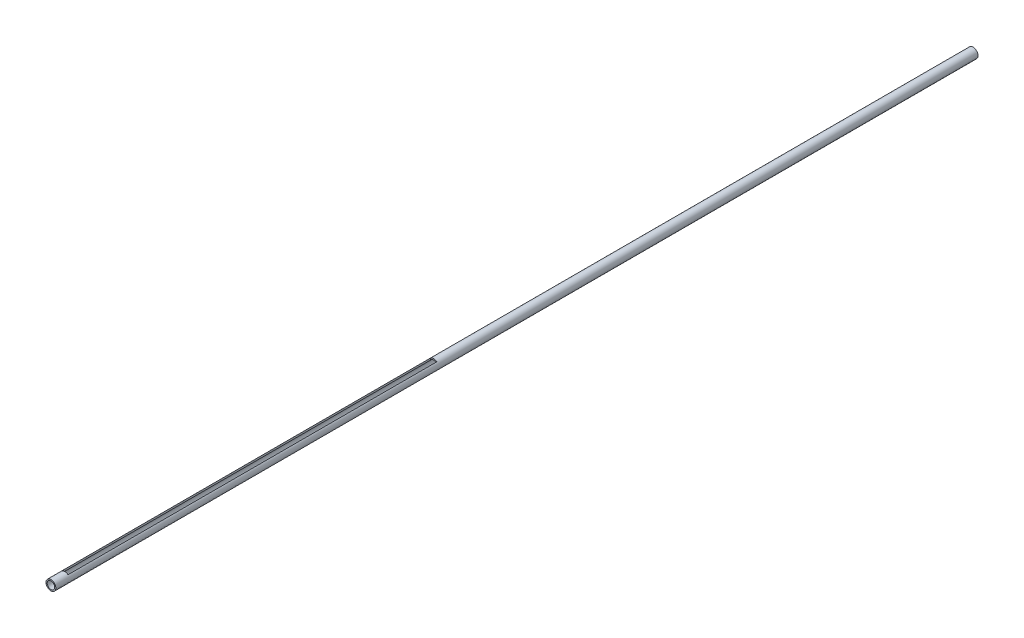
ISO-10303-21;
HEADER;
FILE_DESCRIPTION(('STEP AP214'),'2;1');
FILE_NAME('part.step','',(''),(''),'','','');
FILE_SCHEMA(('AUTOMOTIVE_DESIGN { 1 0 10303 214 1 1 1 1 }'));
ENDSEC;
DATA;
#1=APPLICATION_CONTEXT('core data for automotive mechanical design processes');
#2=APPLICATION_PROTOCOL_DEFINITION('international standard','automotive_design',2000,#1);
#3=PRODUCT_CONTEXT('',#1,'mechanical');
#4=PRODUCT('Part','Part','',(#3));
#5=PRODUCT_RELATED_PRODUCT_CATEGORY('part','',(#4));
#6=PRODUCT_DEFINITION_FORMATION('','',#4);
#7=PRODUCT_DEFINITION_CONTEXT('part definition',#1,'design');
#8=PRODUCT_DEFINITION('design','',#6,#7);
#9=PRODUCT_DEFINITION_SHAPE('','',#8);
#10=(LENGTH_UNIT() NAMED_UNIT(*) SI_UNIT(.MILLI.,.METRE.));
#11=(NAMED_UNIT(*) PLANE_ANGLE_UNIT() SI_UNIT($,.RADIAN.));
#12=(NAMED_UNIT(*) SI_UNIT($,.STERADIAN.) SOLID_ANGLE_UNIT());
#13=UNCERTAINTY_MEASURE_WITH_UNIT(LENGTH_MEASURE(1.E-05),#10,'distance_accuracy_value','');
#14=(GEOMETRIC_REPRESENTATION_CONTEXT(3) GLOBAL_UNCERTAINTY_ASSIGNED_CONTEXT((#13)) GLOBAL_UNIT_ASSIGNED_CONTEXT((#10,
#11,#12)) REPRESENTATION_CONTEXT('',''));
#15=CARTESIAN_POINT('',(0.,0.,0.));
#16=DIRECTION('',(0.,0.,1.));
#17=DIRECTION('',(1.,0.,0.));
#18=AXIS2_PLACEMENT_3D('',#15,#16,#17);
#19=CARTESIAN_POINT('',(0.,0.,100.));
#20=DIRECTION('',(0.,0.,-1.));
#21=DIRECTION('',(-1.,0.,0.));
#22=AXIS2_PLACEMENT_3D('',#19,#20,#21);
#23=CYLINDRICAL_SURFACE('',#22,0.535);
#24=CARTESIAN_POINT('',(0.,0.,100.));
#25=DIRECTION('',(0.,0.,1.));
#26=DIRECTION('',(1.,0.,0.));
#27=AXIS2_PLACEMENT_3D('',#24,#25,#26);
#28=CIRCLE('',#27,0.535);
#29=CARTESIAN_POINT('',(0.535,0.,100.));
#30=VERTEX_POINT('',#29);
#31=EDGE_CURVE('E100',#30,#30,#28,.T.);
#32=ORIENTED_EDGE('',*,*,#31,.F.);
#33=EDGE_LOOP('',(#32));
#34=FACE_BOUND('',#33,.T.);
#35=CARTESIAN_POINT('',(0.,0.,0.));
#36=DIRECTION('',(0.,0.,1.));
#37=DIRECTION('',(1.,0.,0.));
#38=AXIS2_PLACEMENT_3D('',#35,#36,#37);
#39=CIRCLE('',#38,0.535);
#40=CARTESIAN_POINT('',(0.535,0.,0.));
#41=VERTEX_POINT('',#40);
#42=EDGE_CURVE('E98',#41,#41,#39,.T.);
#43=ORIENTED_EDGE('',*,*,#42,.T.);
#44=EDGE_LOOP('',(#43));
#45=FACE_BOUND('',#44,.T.);
#46=CARTESIAN_POINT('',(0.,0.,58.5));
#47=DIRECTION('',(0.,0.,1.));
#48=DIRECTION('',(1.,0.,0.));
#49=AXIS2_PLACEMENT_3D('',#46,#47,#48);
#50=CIRCLE('',#49,0.535);
#51=CARTESIAN_POINT('',(0.35,0.404629460123704,58.5));
#52=VERTEX_POINT('',#51);
#53=CARTESIAN_POINT('',(-0.35,0.404629460123704,58.5));
#54=VERTEX_POINT('',#53);
#55=EDGE_CURVE('E72',#52,#54,#50,.T.);
#56=ORIENTED_EDGE('',*,*,#55,.F.);
#57=DIRECTION('',(0.,0.,-1.));
#58=VECTOR('',#57,1.);
#59=CARTESIAN_POINT('',(0.35,0.404629460123704,100.));
#60=LINE('',#59,#58);
#61=CARTESIAN_POINT('',(0.35,0.404629460123704,98.5));
#62=VERTEX_POINT('',#61);
#63=EDGE_CURVE('E79',#62,#52,#60,.T.);
#64=ORIENTED_EDGE('',*,*,#63,.F.);
#65=CARTESIAN_POINT('',(0.,0.,98.5));
#66=DIRECTION('',(0.,0.,-1.));
#67=DIRECTION('',(-1.,0.,0.));
#68=AXIS2_PLACEMENT_3D('',#65,#66,#67);
#69=CIRCLE('',#68,0.535);
#70=CARTESIAN_POINT('',(-0.350000000000041,0.404629460123669,98.5));
#71=VERTEX_POINT('',#70);
#72=EDGE_CURVE('E88',#71,#62,#69,.T.);
#73=ORIENTED_EDGE('',*,*,#72,.F.);
#74=DIRECTION('',(0.,0.,-1.));
#75=VECTOR('',#74,1.);
#76=CARTESIAN_POINT('',(-0.350000000000042,0.404629460123667,100.));
#77=LINE('',#76,#75);
#78=EDGE_CURVE('E84',#54,#71,#77,.F.);
#79=ORIENTED_EDGE('',*,*,#78,.F.);
#80=EDGE_LOOP('',(#56,#64,#73,#79));
#81=FACE_BOUND('',#80,.T.);
#82=ADVANCED_FACE('F32',(#34,#45,#81),#23,.T.);
#83=CARTESIAN_POINT('',(0.,0.,100.));
#84=DIRECTION('',(0.,0.,-1.));
#85=DIRECTION('',(-1.,0.,0.));
#86=AXIS2_PLACEMENT_3D('',#83,#84,#85);
#87=CYLINDRICAL_SURFACE('',#86,0.405);
#88=CARTESIAN_POINT('',(0.,0.,0.));
#89=DIRECTION('',(0.,0.,1.));
#90=DIRECTION('',(1.,0.,0.));
#91=AXIS2_PLACEMENT_3D('',#88,#89,#90);
#92=CIRCLE('',#91,0.405);
#93=CARTESIAN_POINT('',(0.405,0.,0.));
#94=VERTEX_POINT('',#93);
#95=EDGE_CURVE('E89',#94,#94,#92,.T.);
#96=ORIENTED_EDGE('',*,*,#95,.F.);
#97=EDGE_LOOP('',(#96));
#98=FACE_BOUND('',#97,.T.);
#99=CARTESIAN_POINT('',(0.,0.,100.));
#100=DIRECTION('',(0.,0.,1.));
#101=DIRECTION('',(1.,0.,0.));
#102=AXIS2_PLACEMENT_3D('',#99,#100,#101);
#103=CIRCLE('',#102,0.405);
#104=CARTESIAN_POINT('',(0.405,0.,100.));
#105=VERTEX_POINT('',#104);
#106=EDGE_CURVE('E92',#105,#105,#103,.T.);
#107=ORIENTED_EDGE('',*,*,#106,.T.);
#108=EDGE_LOOP('',(#107));
#109=FACE_BOUND('',#108,.T.);
#110=CARTESIAN_POINT('',(0.,0.,58.5));
#111=DIRECTION('',(0.,0.,1.));
#112=DIRECTION('',(1.,0.,0.));
#113=AXIS2_PLACEMENT_3D('',#110,#111,#112);
#114=CIRCLE('',#113,0.405);
#115=CARTESIAN_POINT('',(0.35,0.203776838723149,58.5));
#116=VERTEX_POINT('',#115);
#117=CARTESIAN_POINT('',(-0.35,0.203776838723149,58.5));
#118=VERTEX_POINT('',#117);
#119=EDGE_CURVE('E103',#116,#118,#114,.T.);
#120=ORIENTED_EDGE('',*,*,#119,.T.);
#121=DIRECTION('',(0.,0.,-1.));
#122=VECTOR('',#121,1.);
#123=CARTESIAN_POINT('',(-0.350000000000042,0.203776838723076,100.));
#124=LINE('',#123,#122);
#125=CARTESIAN_POINT('',(-0.350000000000041,0.203776838723079,98.5));
#126=VERTEX_POINT('',#125);
#127=EDGE_CURVE('E11',#118,#126,#124,.F.);
#128=ORIENTED_EDGE('',*,*,#127,.T.);
#129=CARTESIAN_POINT('',(0.,0.,98.5));
#130=DIRECTION('',(0.,0.,-1.));
#131=DIRECTION('',(-1.,0.,0.));
#132=AXIS2_PLACEMENT_3D('',#129,#130,#131);
#133=CIRCLE('',#132,0.405);
#134=CARTESIAN_POINT('',(0.35,0.203776838723148,98.5));
#135=VERTEX_POINT('',#134);
#136=EDGE_CURVE('E39',#126,#135,#133,.T.);
#137=ORIENTED_EDGE('',*,*,#136,.T.);
#138=DIRECTION('',(0.,0.,-1.));
#139=VECTOR('',#138,1.);
#140=CARTESIAN_POINT('',(0.35,0.203776838723149,100.));
#141=LINE('',#140,#139);
#142=EDGE_CURVE('E107',#135,#116,#141,.T.);
#143=ORIENTED_EDGE('',*,*,#142,.T.);
#144=EDGE_LOOP('',(#120,#128,#137,#143));
#145=FACE_BOUND('',#144,.T.);
#146=ADVANCED_FACE('F110',(#98,#109,#145),#87,.F.);
#147=CARTESIAN_POINT('',(0.,0.,100.));
#148=DIRECTION('',(0.,0.,1.));
#149=DIRECTION('',(1.,0.,0.));
#150=AXIS2_PLACEMENT_3D('',#147,#148,#149);
#151=PLANE('',#150);
#152=ORIENTED_EDGE('',*,*,#31,.T.);
#153=EDGE_LOOP('',(#152));
#154=FACE_BOUND('',#153,.T.);
#155=ORIENTED_EDGE('',*,*,#106,.F.);
#156=EDGE_LOOP('',(#155));
#157=FACE_BOUND('',#156,.T.);
#158=ADVANCED_FACE('F133',(#154,#157),#151,.T.);
#159=CARTESIAN_POINT('',(0.,0.,0.));
#160=DIRECTION('',(0.,0.,1.));
#161=DIRECTION('',(1.,0.,0.));
#162=AXIS2_PLACEMENT_3D('',#159,#160,#161);
#163=PLANE('',#162);
#164=ORIENTED_EDGE('',*,*,#42,.F.);
#165=EDGE_LOOP('',(#164));
#166=FACE_BOUND('',#165,.T.);
#167=ORIENTED_EDGE('',*,*,#95,.T.);
#168=EDGE_LOOP('',(#167));
#169=FACE_BOUND('',#168,.T.);
#170=ADVANCED_FACE('F126',(#166,#169),#163,.F.);
#171=CARTESIAN_POINT('',(-0.350000000000041,0.535,98.5));
#172=DIRECTION('',(1.,0.,0.));
#173=DIRECTION('',(0.,0.,-1.));
#174=AXIS2_PLACEMENT_3D('',#171,#172,#173);
#175=PLANE('',#174);
#176=ORIENTED_EDGE('',*,*,#78,.T.);
#177=DIRECTION('',(0.,-1.,0.));
#178=VECTOR('',#177,1.);
#179=CARTESIAN_POINT('',(-0.350000000000041,0.535,98.5));
#180=LINE('',#179,#178);
#181=EDGE_CURVE('E80',#71,#126,#180,.T.);
#182=ORIENTED_EDGE('',*,*,#181,.T.);
#183=ORIENTED_EDGE('',*,*,#127,.F.);
#184=DIRECTION('',(0.,-1.,0.));
#185=VECTOR('',#184,1.);
#186=CARTESIAN_POINT('',(-0.35,0.535,58.5));
#187=LINE('',#186,#185);
#188=EDGE_CURVE('E46',#54,#118,#187,.T.);
#189=ORIENTED_EDGE('',*,*,#188,.F.);
#190=EDGE_LOOP('',(#176,#182,#183,#189));
#191=FACE_BOUND('',#190,.T.);
#192=ADVANCED_FACE('F83',(#191),#175,.T.);
#193=CARTESIAN_POINT('',(-0.350000000000041,0.535,98.5));
#194=DIRECTION('',(0.,0.,-1.));
#195=DIRECTION('',(-1.,0.,0.));
#196=AXIS2_PLACEMENT_3D('',#193,#194,#195);
#197=PLANE('',#196);
#198=ORIENTED_EDGE('',*,*,#72,.T.);
#199=DIRECTION('',(0.,-1.,0.));
#200=VECTOR('',#199,1.);
#201=CARTESIAN_POINT('',(0.35,0.535,98.5));
#202=LINE('',#201,#200);
#203=EDGE_CURVE('E114',#62,#135,#202,.T.);
#204=ORIENTED_EDGE('',*,*,#203,.T.);
#205=ORIENTED_EDGE('',*,*,#136,.F.);
#206=ORIENTED_EDGE('',*,*,#181,.F.);
#207=EDGE_LOOP('',(#198,#204,#205,#206));
#208=FACE_BOUND('',#207,.T.);
#209=ADVANCED_FACE('F118',(#208),#197,.T.);
#210=CARTESIAN_POINT('',(0.35,0.535,98.5));
#211=DIRECTION('',(-1.,0.,0.));
#212=DIRECTION('',(0.,0.,1.));
#213=AXIS2_PLACEMENT_3D('',#210,#211,#212);
#214=PLANE('',#213);
#215=ORIENTED_EDGE('',*,*,#63,.T.);
#216=DIRECTION('',(0.,-1.,0.));
#217=VECTOR('',#216,1.);
#218=CARTESIAN_POINT('',(0.35,0.535,58.5));
#219=LINE('',#218,#217);
#220=EDGE_CURVE('E75',#52,#116,#219,.T.);
#221=ORIENTED_EDGE('',*,*,#220,.T.);
#222=ORIENTED_EDGE('',*,*,#142,.F.);
#223=ORIENTED_EDGE('',*,*,#203,.F.);
#224=EDGE_LOOP('',(#215,#221,#222,#223));
#225=FACE_BOUND('',#224,.T.);
#226=ADVANCED_FACE('F112',(#225),#214,.T.);
#227=CARTESIAN_POINT('',(-0.35,0.535,58.5));
#228=DIRECTION('',(0.,0.,1.));
#229=DIRECTION('',(1.,0.,0.));
#230=AXIS2_PLACEMENT_3D('',#227,#228,#229);
#231=PLANE('',#230);
#232=ORIENTED_EDGE('',*,*,#55,.T.);
#233=ORIENTED_EDGE('',*,*,#188,.T.);
#234=ORIENTED_EDGE('',*,*,#119,.F.);
#235=ORIENTED_EDGE('',*,*,#220,.F.);
#236=EDGE_LOOP('',(#232,#233,#234,#235));
#237=FACE_BOUND('',#236,.T.);
#238=ADVANCED_FACE('F73',(#237),#231,.T.);
#239=CLOSED_SHELL('',(#82,#146,#158,#170,#192,#209,#226,#238));
#240=MANIFOLD_SOLID_BREP('B2',#239);
#241=ADVANCED_BREP_SHAPE_REPRESENTATION('',(#18,#240),#14);
#242=SHAPE_DEFINITION_REPRESENTATION(#9,#241);
ENDSEC;
END-ISO-10303-21;
